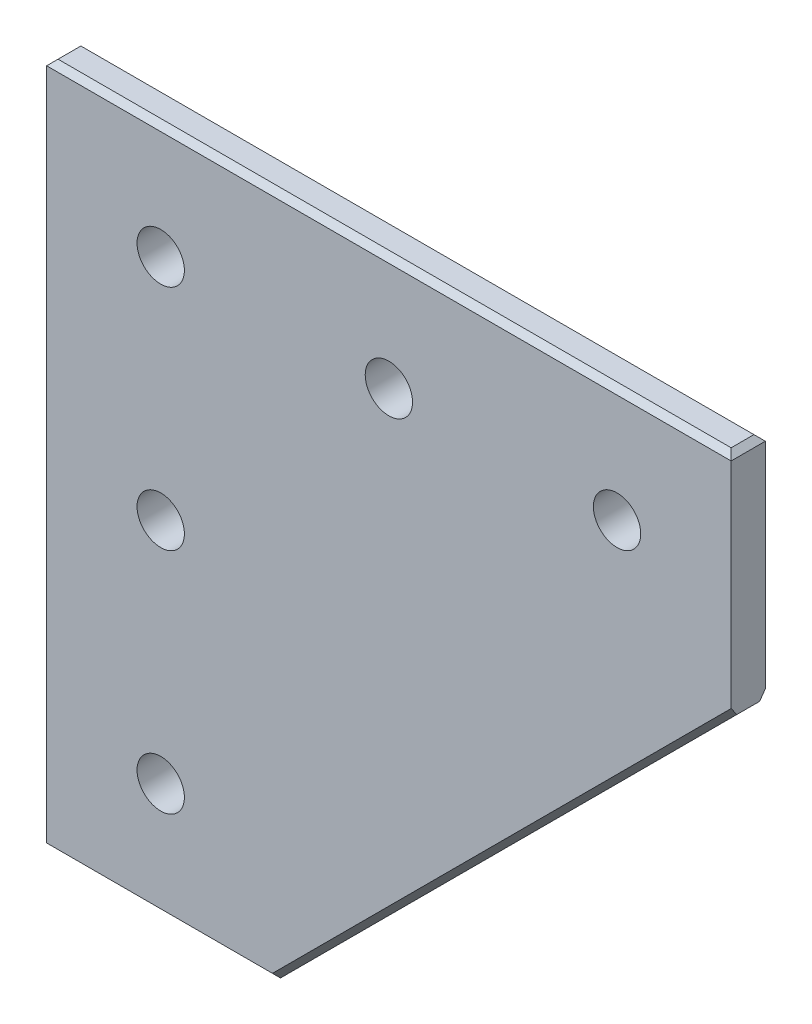
ISO-10303-21;
HEADER;
FILE_DESCRIPTION(('STEP AP214'),'2;1');
FILE_NAME('part.step','',(''),(''),'','','');
FILE_SCHEMA(('AUTOMOTIVE_DESIGN { 1 0 10303 214 1 1 1 1 }'));
ENDSEC;
DATA;
#1=APPLICATION_CONTEXT('core data for automotive mechanical design processes');
#2=APPLICATION_PROTOCOL_DEFINITION('international standard','automotive_design',2000,#1);
#3=PRODUCT_CONTEXT('',#1,'mechanical');
#4=PRODUCT('Part','Part','',(#3));
#5=PRODUCT_RELATED_PRODUCT_CATEGORY('part','',(#4));
#6=PRODUCT_DEFINITION_FORMATION('','',#4);
#7=PRODUCT_DEFINITION_CONTEXT('part definition',#1,'design');
#8=PRODUCT_DEFINITION('design','',#6,#7);
#9=PRODUCT_DEFINITION_SHAPE('','',#8);
#10=(LENGTH_UNIT() NAMED_UNIT(*) SI_UNIT(.MILLI.,.METRE.));
#11=(NAMED_UNIT(*) PLANE_ANGLE_UNIT() SI_UNIT($,.RADIAN.));
#12=(NAMED_UNIT(*) SI_UNIT($,.STERADIAN.) SOLID_ANGLE_UNIT());
#13=UNCERTAINTY_MEASURE_WITH_UNIT(LENGTH_MEASURE(1.E-05),#10,'distance_accuracy_value','');
#14=(GEOMETRIC_REPRESENTATION_CONTEXT(3) GLOBAL_UNCERTAINTY_ASSIGNED_CONTEXT((#13)) GLOBAL_UNIT_ASSIGNED_CONTEXT((#10,
#11,#12)) REPRESENTATION_CONTEXT('',''));
#15=CARTESIAN_POINT('',(0.,0.,0.));
#16=DIRECTION('',(0.,0.,1.));
#17=DIRECTION('',(1.,0.,0.));
#18=AXIS2_PLACEMENT_3D('',#15,#16,#17);
#19=CARTESIAN_POINT('',(-57.484984026,-39.952212756,1.));
#20=DIRECTION('',(0.,1.,0.));
#21=DIRECTION('',(0.,0.,1.));
#22=AXIS2_PLACEMENT_3D('',#19,#20,#21);
#23=PLANE('',#22);
#24=DIRECTION('',(1.,0.,0.));
#25=VECTOR('',#24,1.);
#26=CARTESIAN_POINT('',(-38.484984026,-39.952212756,1.));
#27=LINE('',#26,#25);
#28=CARTESIAN_POINT('',(-57.484984026,-39.952212756,1.00000000068));
#29=VERTEX_POINT('',#28);
#30=CARTESIAN_POINT('',(-18.4849840228976,-39.9522127527047,0.999999996471761));
#31=VERTEX_POINT('',#30);
#32=EDGE_CURVE('E168',#29,#31,#27,.T.);
#33=ORIENTED_EDGE('',*,*,#32,.T.);
#34=DIRECTION('',(0.,0.,1.));
#35=VECTOR('',#34,1.);
#36=CARTESIAN_POINT('',(-18.484984026,-39.952212756,3.));
#37=LINE('',#36,#35);
#38=CARTESIAN_POINT('',(-18.4849840344177,-39.9522127457179,5.00000000977124));
#39=VERTEX_POINT('',#38);
#40=EDGE_CURVE('E155',#31,#39,#37,.T.);
#41=ORIENTED_EDGE('',*,*,#40,.T.);
#42=DIRECTION('',(1.,0.,0.));
#43=VECTOR('',#42,1.);
#44=CARTESIAN_POINT('',(-38.484984026,-39.952212756,5.));
#45=LINE('',#44,#43);
#46=CARTESIAN_POINT('',(-57.48498402736,-39.952212756,5.));
#47=VERTEX_POINT('',#46);
#48=EDGE_CURVE('E152',#47,#39,#45,.T.);
#49=ORIENTED_EDGE('',*,*,#48,.F.);
#50=DIRECTION('',(0.,0.,-1.));
#51=VECTOR('',#50,1.);
#52=CARTESIAN_POINT('',(-57.484984026,-39.952212756,3.));
#53=LINE('',#52,#51);
#54=EDGE_CURVE('E106',#47,#29,#53,.T.);
#55=ORIENTED_EDGE('',*,*,#54,.T.);
#56=EDGE_LOOP('',(#33,#41,#49,#55));
#57=FACE_BOUND('',#56,.T.);
#58=ADVANCED_FACE('F16',(#57),#23,.F.);
#59=CARTESIAN_POINT('',(61.515015974,40.047787244,1.));
#60=DIRECTION('',(-0.707106781186547,0.707106781186548,0.));
#61=DIRECTION('',(-0.707106781186548,-0.707106781186547,0.));
#62=AXIS2_PLACEMENT_3D('',#59,#60,#61);
#63=PLANE('',#62);
#64=DIRECTION('',(-0.707106781186548,-0.707106781186547,0.));
#65=VECTOR('',#64,1.);
#66=CARTESIAN_POINT('',(61.515015974,40.047787244,0.999999992670649));
#67=LINE('',#66,#65);
#68=CARTESIAN_POINT('',(61.5150159752703,40.047787246251,0.999999997240997));
#69=VERTEX_POINT('',#68);
#70=EDGE_CURVE('E207',#31,#69,#67,.F.);
#71=ORIENTED_EDGE('',*,*,#70,.T.);
#72=DIRECTION('',(0.,0.,1.));
#73=VECTOR('',#72,1.);
#74=CARTESIAN_POINT('',(61.515015974,40.047787244,3.));
#75=LINE('',#74,#73);
#76=CARTESIAN_POINT('',(61.5150159746685,40.0477872544425,5.00000000727473));
#77=VERTEX_POINT('',#76);
#78=EDGE_CURVE('E158',#69,#77,#75,.T.);
#79=ORIENTED_EDGE('',*,*,#78,.T.);
#80=DIRECTION('',(0.707106781180829,0.707106781192266,1.44108498402516E-11));
#81=VECTOR('',#80,1.);
#82=CARTESIAN_POINT('',(-18.4849840241356,-39.9522127354358,5.00000001302831));
#83=LINE('',#82,#81);
#84=EDGE_CURVE('E171',#39,#77,#83,.T.);
#85=ORIENTED_EDGE('',*,*,#84,.F.);
#86=ORIENTED_EDGE('',*,*,#40,.F.);
#87=EDGE_LOOP('',(#71,#79,#85,#86));
#88=FACE_BOUND('',#87,.T.);
#89=ADVANCED_FACE('F249',(#88),#63,.F.);
#90=CARTESIAN_POINT('',(60.515015974,80.047787244,-0.036));
#91=DIRECTION('',(-0.707106781186547,-0.707106781186547,0.));
#92=DIRECTION('',(0.707106781186547,-0.707106781186547,0.));
#93=AXIS2_PLACEMENT_3D('',#90,#91,#92);
#94=PLANE('',#93);
#95=DIRECTION('',(0.,0.,-1.));
#96=VECTOR('',#95,1.);
#97=CARTESIAN_POINT('',(61.515015974,79.047787244,3.));
#98=LINE('',#97,#96);
#99=CARTESIAN_POINT('',(61.51501595912,79.047787244,6.));
#100=VERTEX_POINT('',#99);
#101=CARTESIAN_POINT('',(61.515015974372,79.047787244,0.));
#102=VERTEX_POINT('',#101);
#103=EDGE_CURVE('E119',#100,#102,#98,.T.);
#104=ORIENTED_EDGE('',*,*,#103,.T.);
#105=DIRECTION('',(0.577350269285079,-0.577350269141899,-0.577350269141899));
#106=VECTOR('',#105,1.);
#107=CARTESIAN_POINT('',(60.515015974,80.047787244496,1.00000000049599));
#108=LINE('',#107,#106);
#109=CARTESIAN_POINT('',(60.515015974248,80.047787244,1.));
#110=VERTEX_POINT('',#109);
#111=EDGE_CURVE('E20',#110,#102,#108,.T.);
#112=ORIENTED_EDGE('',*,*,#111,.F.);
#113=DIRECTION('',(0.,0.,1.));
#114=VECTOR('',#113,1.);
#115=CARTESIAN_POINT('',(60.515015974,80.047787244,3.));
#116=LINE('',#115,#114);
#117=CARTESIAN_POINT('',(60.51501596544,80.047787244,5.));
#118=VERTEX_POINT('',#117);
#119=EDGE_CURVE('E118',#110,#118,#116,.T.);
#120=ORIENTED_EDGE('',*,*,#119,.T.);
#121=DIRECTION('',(-0.577350264324488,0.577350271622195,-0.577350271622195));
#122=VECTOR('',#121,1.);
#123=CARTESIAN_POINT('',(61.51501594424,79.047787244,6.));
#124=LINE('',#123,#122);
#125=EDGE_CURVE('E140',#100,#118,#124,.T.);
#126=ORIENTED_EDGE('',*,*,#125,.F.);
#127=EDGE_LOOP('',(#104,#112,#120,#126));
#128=FACE_BOUND('',#127,.T.);
#129=ADVANCED_FACE('F239',(#128),#94,.F.);
#130=CARTESIAN_POINT('',(-57.484984026,80.047787244,5.));
#131=DIRECTION('',(0.,-1.,0.));
#132=DIRECTION('',(0.,0.,-1.));
#133=AXIS2_PLACEMENT_3D('',#130,#131,#132);
#134=PLANE('',#133);
#135=ORIENTED_EDGE('',*,*,#119,.F.);
#136=DIRECTION('',(-1.,0.,0.));
#137=VECTOR('',#136,1.);
#138=CARTESIAN_POINT('',(1.51501597400001,80.047787244,1.));
#139=LINE('',#138,#137);
#140=CARTESIAN_POINT('',(-57.484984026,80.047787244,0.99999999572));
#141=VERTEX_POINT('',#140);
#142=EDGE_CURVE('E112',#110,#141,#139,.T.);
#143=ORIENTED_EDGE('',*,*,#142,.T.);
#144=DIRECTION('',(0.,0.,1.));
#145=VECTOR('',#144,1.);
#146=CARTESIAN_POINT('',(-57.484984026,80.047787244,3.));
#147=LINE('',#146,#145);
#148=CARTESIAN_POINT('',(-57.48498401744,80.047787244,5.));
#149=VERTEX_POINT('',#148);
#150=EDGE_CURVE('E96',#141,#149,#147,.T.);
#151=ORIENTED_EDGE('',*,*,#150,.T.);
#152=DIRECTION('',(-1.,0.,0.));
#153=VECTOR('',#152,1.);
#154=CARTESIAN_POINT('',(1.51501597400001,80.047787244,5.));
#155=LINE('',#154,#153);
#156=EDGE_CURVE('E138',#118,#149,#155,.T.);
#157=ORIENTED_EDGE('',*,*,#156,.F.);
#158=EDGE_LOOP('',(#135,#143,#151,#157));
#159=FACE_BOUND('',#158,.T.);
#160=ADVANCED_FACE('F117',(#159),#134,.F.);
#161=CARTESIAN_POINT('',(-57.484984026,-39.952212756,-0.036));
#162=DIRECTION('',(0.707106781186547,0.707106781186547,0.));
#163=DIRECTION('',(-0.707106781186547,0.707106781186547,0.));
#164=AXIS2_PLACEMENT_3D('',#161,#162,#163);
#165=PLANE('',#164);
#166=DIRECTION('',(0.,0.,-1.));
#167=VECTOR('',#166,1.);
#168=CARTESIAN_POINT('',(-58.484984026,-38.952212756,3.));
#169=LINE('',#168,#167);
#170=CARTESIAN_POINT('',(-58.48498402104,-38.952212756,6.));
#171=VERTEX_POINT('',#170);
#172=CARTESIAN_POINT('',(-58.484984026,-38.952212756,-2.47999882665115E-09));
#173=VERTEX_POINT('',#172);
#174=EDGE_CURVE('E115',#171,#173,#169,.T.);
#175=ORIENTED_EDGE('',*,*,#174,.T.);
#176=DIRECTION('',(0.57735026797334,-0.57735026797334,0.577350271622197));
#177=VECTOR('',#176,1.);
#178=CARTESIAN_POINT('',(-58.48498402104,-38.95221276096,0.));
#179=LINE('',#178,#177);
#180=EDGE_CURVE('E170',#173,#29,#179,.T.);
#181=ORIENTED_EDGE('',*,*,#180,.T.);
#182=ORIENTED_EDGE('',*,*,#54,.F.);
#183=DIRECTION('',(0.57735026432449,-0.577350271622193,-0.577350271622195));
#184=VECTOR('',#183,1.);
#185=CARTESIAN_POINT('',(-58.48498401608,-38.952212756,6.));
#186=LINE('',#185,#184);
#187=EDGE_CURVE('E139',#171,#47,#186,.T.);
#188=ORIENTED_EDGE('',*,*,#187,.F.);
#189=EDGE_LOOP('',(#175,#181,#182,#188));
#190=FACE_BOUND('',#189,.T.);
#191=ADVANCED_FACE('F226',(#190),#165,.F.);
#192=CARTESIAN_POINT('',(-58.484984026,79.047787244,-0.036));
#193=DIRECTION('',(0.70710678118655,-0.707106781186545,0.));
#194=DIRECTION('',(0.707106781186545,0.70710678118655,0.));
#195=AXIS2_PLACEMENT_3D('',#192,#193,#194);
#196=PLANE('',#195);
#197=DIRECTION('',(0.,0.,1.));
#198=VECTOR('',#197,1.);
#199=CARTESIAN_POINT('',(-58.484984026,79.047787244,3.));
#200=LINE('',#199,#198);
#201=CARTESIAN_POINT('',(-58.484984026,79.047787244,-7.43999827024222E-09));
#202=VERTEX_POINT('',#201);
#203=CARTESIAN_POINT('',(-58.48498401112,79.047787244,6.));
#204=VERTEX_POINT('',#203);
#205=EDGE_CURVE('E34',#202,#204,#200,.T.);
#206=ORIENTED_EDGE('',*,*,#205,.T.);
#207=DIRECTION('',(-0.577350264324488,-0.577350271622195,0.577350271622195));
#208=VECTOR('',#207,1.);
#209=CARTESIAN_POINT('',(-57.48498400888,80.047787244,5.));
#210=LINE('',#209,#208);
#211=EDGE_CURVE('E101',#149,#204,#210,.T.);
#212=ORIENTED_EDGE('',*,*,#211,.F.);
#213=ORIENTED_EDGE('',*,*,#150,.F.);
#214=DIRECTION('',(-0.577350267973341,-0.577350267973341,-0.577350271622195));
#215=VECTOR('',#214,1.);
#216=CARTESIAN_POINT('',(-57.48498401744,80.04778725256,1.));
#217=LINE('',#216,#215);
#218=EDGE_CURVE('E99',#141,#202,#217,.T.);
#219=ORIENTED_EDGE('',*,*,#218,.T.);
#220=EDGE_LOOP('',(#206,#212,#213,#219));
#221=FACE_BOUND('',#220,.T.);
#222=ADVANCED_FACE('F98',(#221),#196,.F.);
#223=CARTESIAN_POINT('',(-59.204984026,80.047787244,5.));
#224=DIRECTION('',(0.,0.707106781186547,0.707106781186548));
#225=DIRECTION('',(0.,-0.707106781186548,0.707106781186547));
#226=AXIS2_PLACEMENT_3D('',#223,#224,#225);
#227=PLANE('',#226);
#228=ORIENTED_EDGE('',*,*,#125,.T.);
#229=ORIENTED_EDGE('',*,*,#156,.T.);
#230=ORIENTED_EDGE('',*,*,#211,.T.);
#231=DIRECTION('',(-1.,0.,0.));
#232=VECTOR('',#231,1.);
#233=CARTESIAN_POINT('',(1.51501597400001,79.047787244,6.));
#234=LINE('',#233,#232);
#235=EDGE_CURVE('E134',#100,#204,#234,.T.);
#236=ORIENTED_EDGE('',*,*,#235,.F.);
#237=EDGE_LOOP('',(#228,#229,#230,#236));
#238=FACE_BOUND('',#237,.T.);
#239=ADVANCED_FACE('F218',(#238),#227,.T.);
#240=CARTESIAN_POINT('',(-58.724984026,-38.952212756,6.));
#241=DIRECTION('',(0.,-0.70710678118655,0.707106781186545));
#242=DIRECTION('',(0.,-0.707106781186545,-0.70710678118655));
#243=AXIS2_PLACEMENT_3D('',#240,#241,#242);
#244=PLANE('',#243);
#245=ORIENTED_EDGE('',*,*,#187,.T.);
#246=ORIENTED_EDGE('',*,*,#48,.T.);
#247=DIRECTION('',(0.281084623792711,-0.678598353690695,-0.678598341167725));
#248=VECTOR('',#247,1.);
#249=CARTESIAN_POINT('',(-18.8991975646261,-38.952212725259,6.00000000475096));
#250=LINE('',#249,#248);
#251=CARTESIAN_POINT('',(-18.8991975516377,-38.9522127527512,5.99999999675124));
#252=VERTEX_POINT('',#251);
#253=EDGE_CURVE('E154',#252,#39,#250,.T.);
#254=ORIENTED_EDGE('',*,*,#253,.F.);
#255=DIRECTION('',(1.,0.,0.));
#256=VECTOR('',#255,1.);
#257=CARTESIAN_POINT('',(1.51501597400001,-38.952212756,6.));
#258=LINE('',#257,#256);
#259=EDGE_CURVE('E145',#171,#252,#258,.T.);
#260=ORIENTED_EDGE('',*,*,#259,.F.);
#261=EDGE_LOOP('',(#245,#246,#254,#260));
#262=FACE_BOUND('',#261,.T.);
#263=ADVANCED_FACE('F231',(#262),#244,.T.);
#264=CARTESIAN_POINT('',(-19.71984463,-40.440698037,5.527767052));
#265=DIRECTION('',(0.499999999996151,-0.500000000002475,0.70710678118752));
#266=DIRECTION('',(0.816496580930196,0.,-0.577350269186133));
#267=AXIS2_PLACEMENT_3D('',#264,#265,#266);
#268=PLANE('',#267);
#269=ORIENTED_EDGE('',*,*,#253,.T.);
#270=ORIENTED_EDGE('',*,*,#84,.T.);
#271=DIRECTION('',(-1.61606986545497E-09,0.816496580388064,0.577350269952824));
#272=VECTOR('',#271,1.);
#273=CARTESIAN_POINT('',(61.5150159748913,40.0477872431087,4.99999999926053));
#274=LINE('',#273,#272);
#275=CARTESIAN_POINT('',(61.5150159735231,41.4620007978617,6.));
#276=VERTEX_POINT('',#275);
#277=EDGE_CURVE('E121',#77,#276,#274,.T.);
#278=ORIENTED_EDGE('',*,*,#277,.T.);
#279=DIRECTION('',(0.707106781063441,0.707106781309654,0.));
#280=VECTOR('',#279,1.);
#281=CARTESIAN_POINT('',(-18.899197546,-38.952212756,6.));
#282=LINE('',#281,#280);
#283=EDGE_CURVE('E149',#252,#276,#282,.T.);
#284=ORIENTED_EDGE('',*,*,#283,.F.);
#285=EDGE_LOOP('',(#269,#270,#278,#284));
#286=FACE_BOUND('',#285,.T.);
#287=ADVANCED_FACE('F247',(#286),#268,.T.);
#288=CARTESIAN_POINT('',(-58.724984026,-38.952212756,0.));
#289=DIRECTION('',(0.,0.70710678118655,0.707106781186545));
#290=DIRECTION('',(0.,-0.707106781186545,0.70710678118655));
#291=AXIS2_PLACEMENT_3D('',#288,#289,#290);
#292=PLANE('',#291);
#293=DIRECTION('',(1.,0.,0.));
#294=VECTOR('',#293,1.);
#295=CARTESIAN_POINT('',(1.51501597400001,-38.952212756,0.));
#296=LINE('',#295,#294);
#297=CARTESIAN_POINT('',(-18.8991975622998,-38.952212756,3.769611751883E-09));
#298=VERTEX_POINT('',#297);
#299=EDGE_CURVE('E162',#173,#298,#296,.T.);
#300=ORIENTED_EDGE('',*,*,#299,.T.);
#301=DIRECTION('',(0.28108462379271,-0.678598347429208,0.678598347429213));
#302=VECTOR('',#301,1.);
#303=CARTESIAN_POINT('',(-18.8991975646261,-38.952212738254,-1.77460064601076E-08));
#304=LINE('',#303,#302);
#305=EDGE_CURVE('E204',#298,#31,#304,.T.);
#306=ORIENTED_EDGE('',*,*,#305,.T.);
#307=ORIENTED_EDGE('',*,*,#32,.F.);
#308=ORIENTED_EDGE('',*,*,#180,.F.);
#309=EDGE_LOOP('',(#300,#306,#307,#308));
#310=FACE_BOUND('',#309,.T.);
#311=ADVANCED_FACE('F244',(#310),#292,.F.);
#312=CARTESIAN_POINT('',(-19.71984463,-40.440698037,0.472232948));
#313=DIRECTION('',(-0.499999999996151,0.500000000002474,0.70710678118752));
#314=DIRECTION('',(0.816496580930196,0.,0.577350269186133));
#315=AXIS2_PLACEMENT_3D('',#312,#313,#314);
#316=PLANE('',#315);
#317=DIRECTION('',(0.70710678112723,0.707106781245865,-9.02111693821068E-11));
#318=VECTOR('',#317,1.);
#319=CARTESIAN_POINT('',(-18.8991975566621,-38.9522127453379,1.50784472798329E-08));
#320=LINE('',#319,#318);
#321=CARTESIAN_POINT('',(61.5150159725692,41.4620008003156,2.40968843851741E-09));
#322=VERTEX_POINT('',#321);
#323=EDGE_CURVE('E130',#298,#322,#320,.T.);
#324=ORIENTED_EDGE('',*,*,#323,.T.);
#325=DIRECTION('',(1.61606185311042E-09,-0.816496580388065,0.577350269952821));
#326=VECTOR('',#325,1.);
#327=CARTESIAN_POINT('',(61.5150159720922,41.4620007999078,2.69805011665625E-09));
#328=LINE('',#327,#326);
#329=EDGE_CURVE('E161',#322,#69,#328,.T.);
#330=ORIENTED_EDGE('',*,*,#329,.T.);
#331=ORIENTED_EDGE('',*,*,#70,.F.);
#332=ORIENTED_EDGE('',*,*,#305,.F.);
#333=EDGE_LOOP('',(#324,#330,#331,#332));
#334=FACE_BOUND('',#333,.T.);
#335=ADVANCED_FACE('F252',(#334),#316,.F.);
#336=CARTESIAN_POINT('',(61.515015974,79.047787244,0.));
#337=DIRECTION('',(-1.,0.,0.));
#338=DIRECTION('',(0.,-1.,0.));
#339=AXIS2_PLACEMENT_3D('',#336,#337,#338);
#340=PLANE('',#339);
#341=ORIENTED_EDGE('',*,*,#103,.F.);
#342=DIRECTION('',(0.,1.,0.));
#343=VECTOR('',#342,1.);
#344=CARTESIAN_POINT('',(61.515015974,20.047787244,6.));
#345=LINE('',#344,#343);
#346=EDGE_CURVE('E131',#276,#100,#345,.T.);
#347=ORIENTED_EDGE('',*,*,#346,.F.);
#348=ORIENTED_EDGE('',*,*,#277,.F.);
#349=ORIENTED_EDGE('',*,*,#78,.F.);
#350=ORIENTED_EDGE('',*,*,#329,.F.);
#351=DIRECTION('',(0.,1.,0.));
#352=VECTOR('',#351,1.);
#353=CARTESIAN_POINT('',(61.515015974,20.047787244,0.));
#354=LINE('',#353,#352);
#355=EDGE_CURVE('E127',#322,#102,#354,.T.);
#356=ORIENTED_EDGE('',*,*,#355,.T.);
#357=EDGE_LOOP('',(#341,#347,#348,#349,#350,#356));
#358=FACE_BOUND('',#357,.T.);
#359=ADVANCED_FACE('F236',(#358),#340,.F.);
#360=CARTESIAN_POINT('',(-59.204984026,80.047787244,1.));
#361=DIRECTION('',(0.,-0.707106781186547,0.707106781186548));
#362=DIRECTION('',(0.,-0.707106781186548,-0.707106781186547));
#363=AXIS2_PLACEMENT_3D('',#360,#361,#362);
#364=PLANE('',#363);
#365=ORIENTED_EDGE('',*,*,#142,.F.);
#366=ORIENTED_EDGE('',*,*,#111,.T.);
#367=DIRECTION('',(-1.,0.,0.));
#368=VECTOR('',#367,1.);
#369=CARTESIAN_POINT('',(1.51501597400001,79.047787244,0.));
#370=LINE('',#369,#368);
#371=EDGE_CURVE('E114',#102,#202,#370,.T.);
#372=ORIENTED_EDGE('',*,*,#371,.T.);
#373=ORIENTED_EDGE('',*,*,#218,.F.);
#374=EDGE_LOOP('',(#365,#366,#372,#373));
#375=FACE_BOUND('',#374,.T.);
#376=ADVANCED_FACE('F111',(#375),#364,.F.);
#377=CARTESIAN_POINT('',(-58.484984026,-38.952212756,0.));
#378=DIRECTION('',(1.,0.,0.));
#379=DIRECTION('',(0.,1.,0.));
#380=AXIS2_PLACEMENT_3D('',#377,#378,#379);
#381=PLANE('',#380);
#382=ORIENTED_EDGE('',*,*,#205,.F.);
#383=DIRECTION('',(0.,-1.,0.));
#384=VECTOR('',#383,1.);
#385=CARTESIAN_POINT('',(-58.484984026,20.047787244,0.));
#386=LINE('',#385,#384);
#387=EDGE_CURVE('E126',#202,#173,#386,.T.);
#388=ORIENTED_EDGE('',*,*,#387,.T.);
#389=ORIENTED_EDGE('',*,*,#174,.F.);
#390=DIRECTION('',(0.,-1.,0.));
#391=VECTOR('',#390,1.);
#392=CARTESIAN_POINT('',(-58.484984026,20.047787244,6.));
#393=LINE('',#392,#391);
#394=EDGE_CURVE('E137',#204,#171,#393,.T.);
#395=ORIENTED_EDGE('',*,*,#394,.F.);
#396=EDGE_LOOP('',(#382,#388,#389,#395));
#397=FACE_BOUND('',#396,.T.);
#398=ADVANCED_FACE('F224',(#397),#381,.F.);
#399=CARTESIAN_POINT('',(41.515015974,60.047787244,6.));
#400=DIRECTION('',(0.,0.,-1.));
#401=DIRECTION('',(-1.,0.,0.));
#402=AXIS2_PLACEMENT_3D('',#399,#400,#401);
#403=CYLINDRICAL_SURFACE('',#402,4.15);
#404=CARTESIAN_POINT('',(41.515015974,60.047787244,0.));
#405=DIRECTION('',(0.,0.,-1.));
#406=DIRECTION('',(-1.,0.,0.));
#407=AXIS2_PLACEMENT_3D('',#404,#405,#406);
#408=CIRCLE('',#407,4.15);
#409=CARTESIAN_POINT('',(37.365015974,60.047787244,0.));
#410=VERTEX_POINT('',#409);
#411=EDGE_CURVE('E167',#410,#410,#408,.T.);
#412=ORIENTED_EDGE('',*,*,#411,.T.);
#413=EDGE_LOOP('',(#412));
#414=FACE_BOUND('',#413,.T.);
#415=CARTESIAN_POINT('',(41.515015974,60.047787244,6.));
#416=DIRECTION('',(0.,0.,-1.));
#417=DIRECTION('',(-1.,0.,0.));
#418=AXIS2_PLACEMENT_3D('',#415,#416,#417);
#419=CIRCLE('',#418,4.15);
#420=CARTESIAN_POINT('',(37.365015974,60.047787244,6.));
#421=VERTEX_POINT('',#420);
#422=EDGE_CURVE('E196',#421,#421,#419,.T.);
#423=ORIENTED_EDGE('',*,*,#422,.F.);
#424=EDGE_LOOP('',(#423));
#425=FACE_BOUND('',#424,.T.);
#426=ADVANCED_FACE('F283',(#414,#425),#403,.F.);
#427=CARTESIAN_POINT('',(-38.484984026,-19.952212756,6.));
#428=DIRECTION('',(0.,0.,-1.));
#429=DIRECTION('',(-1.,0.,0.));
#430=AXIS2_PLACEMENT_3D('',#427,#428,#429);
#431=CYLINDRICAL_SURFACE('',#430,4.15000000000001);
#432=CARTESIAN_POINT('',(-38.484984026,-19.952212756,0.));
#433=DIRECTION('',(0.,0.,-1.));
#434=DIRECTION('',(-1.,0.,0.));
#435=AXIS2_PLACEMENT_3D('',#432,#433,#434);
#436=CIRCLE('',#435,4.15000000000001);
#437=CARTESIAN_POINT('',(-42.634984026,-19.952212756,0.));
#438=VERTEX_POINT('',#437);
#439=EDGE_CURVE('E181',#438,#438,#436,.T.);
#440=ORIENTED_EDGE('',*,*,#439,.T.);
#441=EDGE_LOOP('',(#440));
#442=FACE_BOUND('',#441,.T.);
#443=CARTESIAN_POINT('',(-38.484984026,-19.952212756,6.));
#444=DIRECTION('',(0.,0.,-1.));
#445=DIRECTION('',(-1.,0.,0.));
#446=AXIS2_PLACEMENT_3D('',#443,#444,#445);
#447=CIRCLE('',#446,4.15000000000001);
#448=CARTESIAN_POINT('',(-42.634984026,-19.952212756,6.));
#449=VERTEX_POINT('',#448);
#450=EDGE_CURVE('E193',#449,#449,#447,.T.);
#451=ORIENTED_EDGE('',*,*,#450,.F.);
#452=EDGE_LOOP('',(#451));
#453=FACE_BOUND('',#452,.T.);
#454=ADVANCED_FACE('F279',(#442,#453),#431,.F.);
#455=CARTESIAN_POINT('',(-38.484984026,60.047787244,6.));
#456=DIRECTION('',(0.,0.,-1.));
#457=DIRECTION('',(-1.,0.,0.));
#458=AXIS2_PLACEMENT_3D('',#455,#456,#457);
#459=CYLINDRICAL_SURFACE('',#458,4.15000000000001);
#460=CARTESIAN_POINT('',(-38.484984026,60.047787244,0.));
#461=DIRECTION('',(0.,0.,-1.));
#462=DIRECTION('',(-1.,0.,0.));
#463=AXIS2_PLACEMENT_3D('',#460,#461,#462);
#464=CIRCLE('',#463,4.15000000000001);
#465=CARTESIAN_POINT('',(-42.634984026,60.047787244,0.));
#466=VERTEX_POINT('',#465);
#467=EDGE_CURVE('E178',#466,#466,#464,.T.);
#468=ORIENTED_EDGE('',*,*,#467,.T.);
#469=EDGE_LOOP('',(#468));
#470=FACE_BOUND('',#469,.T.);
#471=CARTESIAN_POINT('',(-38.484984026,60.047787244,6.));
#472=DIRECTION('',(0.,0.,-1.));
#473=DIRECTION('',(-1.,0.,0.));
#474=AXIS2_PLACEMENT_3D('',#471,#472,#473);
#475=CIRCLE('',#474,4.15000000000001);
#476=CARTESIAN_POINT('',(-42.634984026,60.047787244,6.));
#477=VERTEX_POINT('',#476);
#478=EDGE_CURVE('E190',#477,#477,#475,.T.);
#479=ORIENTED_EDGE('',*,*,#478,.F.);
#480=EDGE_LOOP('',(#479));
#481=FACE_BOUND('',#480,.T.);
#482=ADVANCED_FACE('F275',(#470,#481),#459,.F.);
#483=CARTESIAN_POINT('',(-38.484984026,20.047787244,6.));
#484=DIRECTION('',(0.,0.,-1.));
#485=DIRECTION('',(-1.,0.,0.));
#486=AXIS2_PLACEMENT_3D('',#483,#484,#485);
#487=CYLINDRICAL_SURFACE('',#486,4.15000000000001);
#488=CARTESIAN_POINT('',(-38.484984026,20.047787244,0.));
#489=DIRECTION('',(0.,0.,-1.));
#490=DIRECTION('',(-1.,0.,0.));
#491=AXIS2_PLACEMENT_3D('',#488,#489,#490);
#492=CIRCLE('',#491,4.15000000000001);
#493=CARTESIAN_POINT('',(-42.634984026,20.047787244,0.));
#494=VERTEX_POINT('',#493);
#495=EDGE_CURVE('E175',#494,#494,#492,.T.);
#496=ORIENTED_EDGE('',*,*,#495,.T.);
#497=EDGE_LOOP('',(#496));
#498=FACE_BOUND('',#497,.T.);
#499=CARTESIAN_POINT('',(-38.484984026,20.047787244,6.));
#500=DIRECTION('',(0.,0.,-1.));
#501=DIRECTION('',(-1.,0.,0.));
#502=AXIS2_PLACEMENT_3D('',#499,#500,#501);
#503=CIRCLE('',#502,4.15000000000001);
#504=CARTESIAN_POINT('',(-42.634984026,20.047787244,6.));
#505=VERTEX_POINT('',#504);
#506=EDGE_CURVE('E165',#505,#505,#503,.T.);
#507=ORIENTED_EDGE('',*,*,#506,.F.);
#508=EDGE_LOOP('',(#507));
#509=FACE_BOUND('',#508,.T.);
#510=ADVANCED_FACE('F272',(#498,#509),#487,.F.);
#511=CARTESIAN_POINT('',(-58.484984026,-38.952212756,6.));
#512=DIRECTION('',(0.,0.,1.));
#513=DIRECTION('',(1.,0.,0.));
#514=AXIS2_PLACEMENT_3D('',#511,#512,#513);
#515=PLANE('',#514);
#516=CARTESIAN_POINT('',(1.515015974,60.047787244,6.));
#517=DIRECTION('',(0.,0.,-1.));
#518=DIRECTION('',(-1.,0.,0.));
#519=AXIS2_PLACEMENT_3D('',#516,#517,#518);
#520=CIRCLE('',#519,4.15);
#521=CARTESIAN_POINT('',(-2.634984026,60.047787244,6.));
#522=VERTEX_POINT('',#521);
#523=EDGE_CURVE('E26',#522,#522,#520,.F.);
#524=ORIENTED_EDGE('',*,*,#523,.F.);
#525=EDGE_LOOP('',(#524));
#526=FACE_BOUND('',#525,.T.);
#527=ORIENTED_EDGE('',*,*,#506,.T.);
#528=EDGE_LOOP('',(#527));
#529=FACE_BOUND('',#528,.T.);
#530=ORIENTED_EDGE('',*,*,#478,.T.);
#531=EDGE_LOOP('',(#530));
#532=FACE_BOUND('',#531,.T.);
#533=ORIENTED_EDGE('',*,*,#450,.T.);
#534=EDGE_LOOP('',(#533));
#535=FACE_BOUND('',#534,.T.);
#536=ORIENTED_EDGE('',*,*,#422,.T.);
#537=EDGE_LOOP('',(#536));
#538=FACE_BOUND('',#537,.T.);
#539=ORIENTED_EDGE('',*,*,#259,.T.);
#540=ORIENTED_EDGE('',*,*,#283,.T.);
#541=ORIENTED_EDGE('',*,*,#346,.T.);
#542=ORIENTED_EDGE('',*,*,#235,.T.);
#543=ORIENTED_EDGE('',*,*,#394,.T.);
#544=EDGE_LOOP('',(#539,#540,#541,#542,#543));
#545=FACE_BOUND('',#544,.T.);
#546=ADVANCED_FACE('F220',(#526,#529,#532,#535,#538,#545),#515,.T.);
#547=CARTESIAN_POINT('',(-58.484984026,-38.952212756,0.));
#548=DIRECTION('',(0.,0.,1.));
#549=DIRECTION('',(1.,0.,0.));
#550=AXIS2_PLACEMENT_3D('',#547,#548,#549);
#551=PLANE('',#550);
#552=CARTESIAN_POINT('',(1.515015974,60.047787244,0.));
#553=DIRECTION('',(0.,0.,-1.));
#554=DIRECTION('',(-1.,0.,0.));
#555=AXIS2_PLACEMENT_3D('',#552,#553,#554);
#556=CIRCLE('',#555,4.15);
#557=CARTESIAN_POINT('',(-2.634984026,60.047787244,0.));
#558=VERTEX_POINT('',#557);
#559=EDGE_CURVE('E11',#558,#558,#556,.T.);
#560=ORIENTED_EDGE('',*,*,#559,.F.);
#561=EDGE_LOOP('',(#560));
#562=FACE_BOUND('',#561,.T.);
#563=ORIENTED_EDGE('',*,*,#495,.F.);
#564=EDGE_LOOP('',(#563));
#565=FACE_BOUND('',#564,.T.);
#566=ORIENTED_EDGE('',*,*,#467,.F.);
#567=EDGE_LOOP('',(#566));
#568=FACE_BOUND('',#567,.T.);
#569=ORIENTED_EDGE('',*,*,#439,.F.);
#570=EDGE_LOOP('',(#569));
#571=FACE_BOUND('',#570,.T.);
#572=ORIENTED_EDGE('',*,*,#411,.F.);
#573=EDGE_LOOP('',(#572));
#574=FACE_BOUND('',#573,.T.);
#575=ORIENTED_EDGE('',*,*,#371,.F.);
#576=ORIENTED_EDGE('',*,*,#355,.F.);
#577=ORIENTED_EDGE('',*,*,#323,.F.);
#578=ORIENTED_EDGE('',*,*,#299,.F.);
#579=ORIENTED_EDGE('',*,*,#387,.F.);
#580=EDGE_LOOP('',(#575,#576,#577,#578,#579));
#581=FACE_BOUND('',#580,.T.);
#582=ADVANCED_FACE('F18',(#562,#565,#568,#571,#574,#581),#551,.F.);
#583=CARTESIAN_POINT('',(1.515015974,60.047787244,6.));
#584=DIRECTION('',(0.,0.,-1.));
#585=DIRECTION('',(-1.,0.,0.));
#586=AXIS2_PLACEMENT_3D('',#583,#584,#585);
#587=CYLINDRICAL_SURFACE('',#586,4.15);
#588=ORIENTED_EDGE('',*,*,#559,.T.);
#589=EDGE_LOOP('',(#588));
#590=FACE_BOUND('',#589,.T.);
#591=ORIENTED_EDGE('',*,*,#523,.T.);
#592=EDGE_LOOP('',(#591));
#593=FACE_BOUND('',#592,.T.);
#594=ADVANCED_FACE('F262',(#590,#593),#587,.F.);
#595=CLOSED_SHELL('',(#58,#89,#129,#160,#191,#222,#239,#263,#287,#311,#335,#359,#376,#398,#426,
#454,#482,#510,#546,#582,#594));
#596=MANIFOLD_SOLID_BREP('B1',#595);
#597=ADVANCED_BREP_SHAPE_REPRESENTATION('',(#18,#596),#14);
#598=SHAPE_DEFINITION_REPRESENTATION(#9,#597);
ENDSEC;
END-ISO-10303-21;
